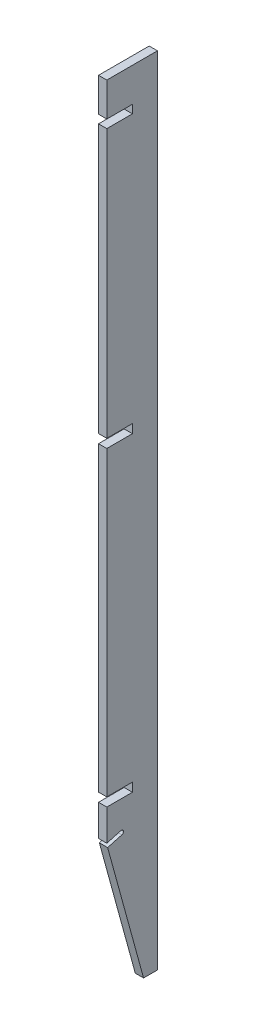
ISO-10303-21;
HEADER;
FILE_DESCRIPTION(('STEP AP214'),'2;1');
FILE_NAME('part.step','',(''),(''),'','','');
FILE_SCHEMA(('AUTOMOTIVE_DESIGN { 1 0 10303 214 1 1 1 1 }'));
ENDSEC;
DATA;
#1=APPLICATION_CONTEXT('core data for automotive mechanical design processes');
#2=APPLICATION_PROTOCOL_DEFINITION('international standard','automotive_design',2000,#1);
#3=PRODUCT_CONTEXT('',#1,'mechanical');
#4=PRODUCT('Part','Part','',(#3));
#5=PRODUCT_RELATED_PRODUCT_CATEGORY('part','',(#4));
#6=PRODUCT_DEFINITION_FORMATION('','',#4);
#7=PRODUCT_DEFINITION_CONTEXT('part definition',#1,'design');
#8=PRODUCT_DEFINITION('design','',#6,#7);
#9=PRODUCT_DEFINITION_SHAPE('','',#8);
#10=(LENGTH_UNIT() NAMED_UNIT(*) SI_UNIT(.MILLI.,.METRE.));
#11=(NAMED_UNIT(*) PLANE_ANGLE_UNIT() SI_UNIT($,.RADIAN.));
#12=(NAMED_UNIT(*) SI_UNIT($,.STERADIAN.) SOLID_ANGLE_UNIT());
#13=UNCERTAINTY_MEASURE_WITH_UNIT(LENGTH_MEASURE(1.E-05),#10,'distance_accuracy_value','');
#14=(GEOMETRIC_REPRESENTATION_CONTEXT(3) GLOBAL_UNCERTAINTY_ASSIGNED_CONTEXT((#13)) GLOBAL_UNIT_ASSIGNED_CONTEXT((#10,
#11,#12)) REPRESENTATION_CONTEXT('',''));
#15=CARTESIAN_POINT('',(0.,0.,0.));
#16=DIRECTION('',(0.,0.,1.));
#17=DIRECTION('',(1.,0.,0.));
#18=AXIS2_PLACEMENT_3D('',#15,#16,#17);
#19=CARTESIAN_POINT('',(-88.646,186.648691114934,38.1));
#20=DIRECTION('',(0.,-0.26471698178117,0.964326147917118));
#21=DIRECTION('',(0.,-0.964326147917118,-0.26471698178117));
#22=AXIS2_PLACEMENT_3D('',#19,#20,#21);
#23=PLANE('',#22);
#24=DIRECTION('',(0.,-0.964326147917118,-0.26471698178117));
#25=VECTOR('',#24,1.);
#26=CARTESIAN_POINT('',(-76.2,186.648691114934,38.1));
#27=LINE('',#26,#25);
#28=CARTESIAN_POINT('',(-76.2,320.899792352557,74.9532434769948));
#29=VERTEX_POINT('',#28);
#30=CARTESIAN_POINT('',(-76.2,124.055833972077,20.9176470588238));
#31=VERTEX_POINT('',#30);
#32=EDGE_CURVE('E286',#29,#31,#27,.T.);
#33=ORIENTED_EDGE('',*,*,#32,.F.);
#34=DIRECTION('',(-1.,0.,0.));
#35=VECTOR('',#34,1.);
#36=CARTESIAN_POINT('',(2294.93415908109,320.899792352557,74.9532434769948));
#37=LINE('',#36,#35);
#38=CARTESIAN_POINT('',(-88.646,320.899792352557,74.9532434769948));
#39=VERTEX_POINT('',#38);
#40=EDGE_CURVE('E35',#29,#39,#37,.T.);
#41=ORIENTED_EDGE('',*,*,#40,.T.);
#42=DIRECTION('',(0.,-0.964326147917118,-0.26471698178117));
#43=VECTOR('',#42,1.);
#44=CARTESIAN_POINT('',(-88.646,186.648691114934,38.1));
#45=LINE('',#44,#43);
#46=CARTESIAN_POINT('',(-88.646,124.055833972077,20.9176470588238));
#47=VERTEX_POINT('',#46);
#48=EDGE_CURVE('E297',#39,#47,#45,.T.);
#49=ORIENTED_EDGE('',*,*,#48,.T.);
#50=DIRECTION('',(1.,0.,0.));
#51=VECTOR('',#50,1.);
#52=CARTESIAN_POINT('',(-88.646,124.055833972077,20.9176470588238));
#53=LINE('',#52,#51);
#54=EDGE_CURVE('E230',#47,#31,#53,.T.);
#55=ORIENTED_EDGE('',*,*,#54,.T.);
#56=EDGE_LOOP('',(#33,#41,#49,#55));
#57=FACE_BOUND('',#56,.T.);
#58=ADVANCED_FACE('F14',(#57),#23,.T.);
#59=CARTESIAN_POINT('',(-88.646,822.325,76.2));
#60=DIRECTION('',(0.,0.,1.));
#61=DIRECTION('',(1.,0.,0.));
#62=AXIS2_PLACEMENT_3D('',#59,#60,#61);
#63=PLANE('',#62);
#64=DIRECTION('',(0.,-1.,0.));
#65=VECTOR('',#64,1.);
#66=CARTESIAN_POINT('',(-76.2,822.325,76.2));
#67=LINE('',#66,#65);
#68=CARTESIAN_POINT('',(-76.2,1257.554,76.2));
#69=VERTEX_POINT('',#68);
#70=CARTESIAN_POINT('',(-76.2,854.329,76.2));
#71=VERTEX_POINT('',#70);
#72=EDGE_CURVE('E293',#69,#71,#67,.T.);
#73=ORIENTED_EDGE('',*,*,#72,.F.);
#74=DIRECTION('',(-1.,0.,0.));
#75=VECTOR('',#74,1.);
#76=CARTESIAN_POINT('',(3476.61458781172,1257.554,76.2));
#77=LINE('',#76,#75);
#78=CARTESIAN_POINT('',(-88.646,1257.554,76.2));
#79=VERTEX_POINT('',#78);
#80=EDGE_CURVE('E331',#69,#79,#77,.T.);
#81=ORIENTED_EDGE('',*,*,#80,.T.);
#82=DIRECTION('',(0.,-1.,0.));
#83=VECTOR('',#82,1.);
#84=CARTESIAN_POINT('',(-88.646,822.325,76.2));
#85=LINE('',#84,#83);
#86=CARTESIAN_POINT('',(-88.646,854.329,76.2));
#87=VERTEX_POINT('',#86);
#88=EDGE_CURVE('E304',#79,#87,#85,.T.);
#89=ORIENTED_EDGE('',*,*,#88,.T.);
#90=DIRECTION('',(-1.,0.,0.));
#91=VECTOR('',#90,1.);
#92=CARTESIAN_POINT('',(3476.61458781172,854.329,76.2));
#93=LINE('',#92,#91);
#94=EDGE_CURVE('E312',#71,#87,#93,.T.);
#95=ORIENTED_EDGE('',*,*,#94,.F.);
#96=EDGE_LOOP('',(#73,#81,#89,#95));
#97=FACE_BOUND('',#96,.T.);
#98=ADVANCED_FACE('F430',(#97),#63,.T.);
#99=DIRECTION('',(-1.,0.,0.));
#100=VECTOR('',#99,1.);
#101=CARTESIAN_POINT('',(-88.646,327.142454536111,76.2));
#102=LINE('',#101,#100);
#103=CARTESIAN_POINT('',(-76.2,327.142454536111,76.2));
#104=VERTEX_POINT('',#103);
#105=CARTESIAN_POINT('',(-88.646,327.142454536111,76.2));
#106=VERTEX_POINT('',#105);
#107=EDGE_CURVE('E382',#104,#106,#102,.T.);
#108=ORIENTED_EDGE('',*,*,#107,.F.);
#109=CARTESIAN_POINT('',(-76.2,374.269,76.2));
#110=VERTEX_POINT('',#109);
#111=EDGE_CURVE('E294',#110,#104,#67,.T.);
#112=ORIENTED_EDGE('',*,*,#111,.F.);
#113=DIRECTION('',(-1.,0.,0.));
#114=VECTOR('',#113,1.);
#115=CARTESIAN_POINT('',(3476.61458781172,374.269,76.2));
#116=LINE('',#115,#114);
#117=CARTESIAN_POINT('',(-88.646,374.269,76.2));
#118=VERTEX_POINT('',#117);
#119=EDGE_CURVE('E362',#110,#118,#116,.T.);
#120=ORIENTED_EDGE('',*,*,#119,.T.);
#121=EDGE_CURVE('E282',#118,#106,#85,.T.);
#122=ORIENTED_EDGE('',*,*,#121,.T.);
#123=EDGE_LOOP('',(#108,#112,#120,#122));
#124=FACE_BOUND('',#123,.T.);
#125=ADVANCED_FACE('F448',(#124),#63,.T.);
#126=DIRECTION('',(-1.,0.,0.));
#127=VECTOR('',#126,1.);
#128=CARTESIAN_POINT('',(3476.61458781172,387.477,76.2));
#129=LINE('',#128,#127);
#130=CARTESIAN_POINT('',(-76.2,387.477,76.2));
#131=VERTEX_POINT('',#130);
#132=CARTESIAN_POINT('',(-88.646,387.477,76.2));
#133=VERTEX_POINT('',#132);
#134=EDGE_CURVE('E366',#131,#133,#129,.T.);
#135=ORIENTED_EDGE('',*,*,#134,.F.);
#136=CARTESIAN_POINT('',(-76.2,841.121,76.2));
#137=VERTEX_POINT('',#136);
#138=EDGE_CURVE('E433',#137,#131,#67,.T.);
#139=ORIENTED_EDGE('',*,*,#138,.F.);
#140=DIRECTION('',(-1.,0.,0.));
#141=VECTOR('',#140,1.);
#142=CARTESIAN_POINT('',(3476.61458781172,841.121,76.2));
#143=LINE('',#142,#141);
#144=CARTESIAN_POINT('',(-88.646,841.121,76.2));
#145=VERTEX_POINT('',#144);
#146=EDGE_CURVE('E315',#137,#145,#143,.T.);
#147=ORIENTED_EDGE('',*,*,#146,.T.);
#148=EDGE_CURVE('E454',#145,#133,#85,.T.);
#149=ORIENTED_EDGE('',*,*,#148,.T.);
#150=EDGE_LOOP('',(#135,#139,#147,#149));
#151=FACE_BOUND('',#150,.T.);
#152=ADVANCED_FACE('F475',(#151),#63,.T.);
#153=CARTESIAN_POINT('',(-88.646,709.72791698604,44.45));
#154=DIRECTION('',(1.,0.,0.));
#155=DIRECTION('',(0.,1.,0.));
#156=AXIS2_PLACEMENT_3D('',#153,#154,#155);
#157=PLANE('',#156);
#158=CARTESIAN_POINT('',(-88.646,329.844862792281,54.361571256692));
#159=DIRECTION('',(1.,0.,0.));
#160=DIRECTION('',(0.,1.,0.));
#161=AXIS2_PLACEMENT_3D('',#158,#159,#160);
#162=CIRCLE('',#161,3.175);
#163=CARTESIAN_POINT('',(-88.646,326.783127272644,53.5210948395368));
#164=VERTEX_POINT('',#163);
#165=CARTESIAN_POINT('',(-88.646,332.906598311917,55.2020476738473));
#166=VERTEX_POINT('',#165);
#167=EDGE_CURVE('E211',#164,#166,#162,.T.);
#168=ORIENTED_EDGE('',*,*,#167,.T.);
#169=DIRECTION('',(0.,-0.26471698178117,0.964326147917118));
#170=VECTOR('',#169,1.);
#171=CARTESIAN_POINT('',(-88.646,362.057095451444,-50.9890490487127));
#172=LINE('',#171,#170);
#173=EDGE_CURVE('E356',#166,#106,#172,.T.);
#174=ORIENTED_EDGE('',*,*,#173,.T.);
#175=ORIENTED_EDGE('',*,*,#121,.F.);
#176=DIRECTION('',(0.,0.,-1.));
#177=VECTOR('',#176,1.);
#178=CARTESIAN_POINT('',(-88.646,374.269,44.45));
#179=LINE('',#178,#177);
#180=CARTESIAN_POINT('',(-88.646,374.269,37.719));
#181=VERTEX_POINT('',#180);
#182=EDGE_CURVE('E369',#118,#181,#179,.T.);
#183=ORIENTED_EDGE('',*,*,#182,.T.);
#184=DIRECTION('',(0.,-1.,0.));
#185=VECTOR('',#184,1.);
#186=CARTESIAN_POINT('',(-88.646,847.725,37.719));
#187=LINE('',#186,#185);
#188=CARTESIAN_POINT('',(-88.646,387.477,37.719));
#189=VERTEX_POINT('',#188);
#190=EDGE_CURVE('E373',#189,#181,#187,.T.);
#191=ORIENTED_EDGE('',*,*,#190,.F.);
#192=DIRECTION('',(0.,0.,1.));
#193=VECTOR('',#192,1.);
#194=CARTESIAN_POINT('',(-88.646,387.477,44.45));
#195=LINE('',#194,#193);
#196=EDGE_CURVE('E345',#189,#133,#195,.T.);
#197=ORIENTED_EDGE('',*,*,#196,.T.);
#198=ORIENTED_EDGE('',*,*,#148,.F.);
#199=DIRECTION('',(0.,0.,-1.));
#200=VECTOR('',#199,1.);
#201=CARTESIAN_POINT('',(-88.646,841.121,38.1));
#202=LINE('',#201,#200);
#203=CARTESIAN_POINT('',(-88.646,841.121,37.719));
#204=VERTEX_POINT('',#203);
#205=EDGE_CURVE('E309',#145,#204,#202,.T.);
#206=ORIENTED_EDGE('',*,*,#205,.T.);
#207=DIRECTION('',(0.,-1.,0.));
#208=VECTOR('',#207,1.);
#209=CARTESIAN_POINT('',(-88.646,847.725,37.719));
#210=LINE('',#209,#208);
#211=CARTESIAN_POINT('',(-88.646,854.329,37.719));
#212=VERTEX_POINT('',#211);
#213=EDGE_CURVE('E326',#212,#204,#210,.T.);
#214=ORIENTED_EDGE('',*,*,#213,.F.);
#215=DIRECTION('',(0.,0.,1.));
#216=VECTOR('',#215,1.);
#217=CARTESIAN_POINT('',(-88.646,854.329,38.1));
#218=LINE('',#217,#216);
#219=EDGE_CURVE('E322',#212,#87,#218,.T.);
#220=ORIENTED_EDGE('',*,*,#219,.T.);
#221=ORIENTED_EDGE('',*,*,#88,.F.);
#222=DIRECTION('',(0.,0.,1.));
#223=VECTOR('',#222,1.);
#224=CARTESIAN_POINT('',(-88.646,1257.554,56.9595));
#225=LINE('',#224,#223);
#226=CARTESIAN_POINT('',(-88.646,1257.554,37.719));
#227=VERTEX_POINT('',#226);
#228=EDGE_CURVE('E353',#227,#79,#225,.T.);
#229=ORIENTED_EDGE('',*,*,#228,.F.);
#230=DIRECTION('',(0.,1.,0.));
#231=VECTOR('',#230,1.);
#232=CARTESIAN_POINT('',(-88.646,1263.777,37.719));
#233=LINE('',#232,#231);
#234=CARTESIAN_POINT('',(-88.646,1270.,37.719));
#235=VERTEX_POINT('',#234);
#236=EDGE_CURVE('E349',#227,#235,#233,.T.);
#237=ORIENTED_EDGE('',*,*,#236,.T.);
#238=DIRECTION('',(0.,0.,-1.));
#239=VECTOR('',#238,1.);
#240=CARTESIAN_POINT('',(-88.646,1270.,56.9595));
#241=LINE('',#240,#239);
#242=CARTESIAN_POINT('',(-88.646,1270.,76.2));
#243=VERTEX_POINT('',#242);
#244=EDGE_CURVE('E336',#243,#235,#241,.T.);
#245=ORIENTED_EDGE('',*,*,#244,.F.);
#246=CARTESIAN_POINT('',(-88.646,1320.8,76.2));
#247=VERTEX_POINT('',#246);
#248=EDGE_CURVE('E300',#247,#243,#85,.T.);
#249=ORIENTED_EDGE('',*,*,#248,.F.);
#250=DIRECTION('',(0.,0.,1.));
#251=VECTOR('',#250,1.);
#252=CARTESIAN_POINT('',(-88.646,1320.8,44.45));
#253=LINE('',#252,#251);
#254=CARTESIAN_POINT('',(-88.646,1320.8,0.));
#255=VERTEX_POINT('',#254);
#256=EDGE_CURVE('E271',#255,#247,#253,.T.);
#257=ORIENTED_EDGE('',*,*,#256,.F.);
#258=DIRECTION('',(0.,1.,0.));
#259=VECTOR('',#258,1.);
#260=CARTESIAN_POINT('',(-88.646,709.72791698604,1.196959198424E-13));
#261=LINE('',#260,#259);
#262=CARTESIAN_POINT('',(-88.646,124.055833972077,2.25611489484112E-13));
#263=VERTEX_POINT('',#262);
#264=EDGE_CURVE('E275',#263,#255,#261,.T.);
#265=ORIENTED_EDGE('',*,*,#264,.F.);
#266=DIRECTION('',(0.,0.,-1.));
#267=VECTOR('',#266,1.);
#268=CARTESIAN_POINT('',(-88.646,124.055833972077,20.9176470588238));
#269=LINE('',#268,#267);
#270=EDGE_CURVE('E204',#263,#47,#269,.F.);
#271=ORIENTED_EDGE('',*,*,#270,.T.);
#272=ORIENTED_EDGE('',*,*,#48,.F.);
#273=DIRECTION('',(0.,-0.26471698178117,0.964326147917118));
#274=VECTOR('',#273,1.);
#275=CARTESIAN_POINT('',(-88.646,355.93362441217,-52.6700018830231));
#276=LINE('',#275,#274);
#277=EDGE_CURVE('E387',#164,#39,#276,.T.);
#278=ORIENTED_EDGE('',*,*,#277,.F.);
#279=EDGE_LOOP('',(#168,#174,#175,#183,#191,#197,#198,#206,#214,#220,#221,#229,#237,#245,#249,
#257,#265,#271,#272,#278));
#280=FACE_BOUND('',#279,.T.);
#281=ADVANCED_FACE('F397',(#280),#157,.F.);
#282=CARTESIAN_POINT('',(-76.2,709.72791698604,44.45));
#283=DIRECTION('',(1.,0.,0.));
#284=DIRECTION('',(0.,1.,0.));
#285=AXIS2_PLACEMENT_3D('',#282,#283,#284);
#286=PLANE('',#285);
#287=DIRECTION('',(0.,-0.26471698178117,0.964326147917118));
#288=VECTOR('',#287,1.);
#289=CARTESIAN_POINT('',(-76.2,362.057095451444,-50.9890490487127));
#290=LINE('',#289,#288);
#291=CARTESIAN_POINT('',(-76.2,332.906598311917,55.2020476738473));
#292=VERTEX_POINT('',#291);
#293=EDGE_CURVE('E9',#292,#104,#290,.T.);
#294=ORIENTED_EDGE('',*,*,#293,.F.);
#295=CARTESIAN_POINT('',(-76.2,329.844862792281,54.361571256692));
#296=DIRECTION('',(1.,0.,0.));
#297=DIRECTION('',(0.,1.,0.));
#298=AXIS2_PLACEMENT_3D('',#295,#296,#297);
#299=CIRCLE('',#298,3.175);
#300=CARTESIAN_POINT('',(-76.2,326.783127272644,53.5210948395368));
#301=VERTEX_POINT('',#300);
#302=EDGE_CURVE('E23',#301,#292,#299,.T.);
#303=ORIENTED_EDGE('',*,*,#302,.F.);
#304=DIRECTION('',(0.,-0.26471698178117,0.964326147917118));
#305=VECTOR('',#304,1.);
#306=CARTESIAN_POINT('',(-76.2,355.93362441217,-52.6700018830231));
#307=LINE('',#306,#305);
#308=EDGE_CURVE('E195',#301,#29,#307,.T.);
#309=ORIENTED_EDGE('',*,*,#308,.T.);
#310=ORIENTED_EDGE('',*,*,#32,.T.);
#311=DIRECTION('',(0.,0.,1.));
#312=VECTOR('',#311,1.);
#313=CARTESIAN_POINT('',(-76.2,124.055833972077,44.4499999999961));
#314=LINE('',#313,#312);
#315=CARTESIAN_POINT('',(-76.2,124.055833972077,2.25611489484112E-13));
#316=VERTEX_POINT('',#315);
#317=EDGE_CURVE('E227',#31,#316,#314,.F.);
#318=ORIENTED_EDGE('',*,*,#317,.T.);
#319=DIRECTION('',(0.,1.,0.));
#320=VECTOR('',#319,1.);
#321=CARTESIAN_POINT('',(-76.2,709.72791698604,1.196959198424E-13));
#322=LINE('',#321,#320);
#323=CARTESIAN_POINT('',(-76.2,1320.8,0.));
#324=VERTEX_POINT('',#323);
#325=EDGE_CURVE('E283',#316,#324,#322,.T.);
#326=ORIENTED_EDGE('',*,*,#325,.T.);
#327=DIRECTION('',(0.,0.,1.));
#328=VECTOR('',#327,1.);
#329=CARTESIAN_POINT('',(-76.2,1320.8,44.45));
#330=LINE('',#329,#328);
#331=CARTESIAN_POINT('',(-76.2,1320.8,76.2));
#332=VERTEX_POINT('',#331);
#333=EDGE_CURVE('E278',#324,#332,#330,.T.);
#334=ORIENTED_EDGE('',*,*,#333,.T.);
#335=CARTESIAN_POINT('',(-76.2,1270.,76.2));
#336=VERTEX_POINT('',#335);
#337=EDGE_CURVE('E289',#332,#336,#67,.T.);
#338=ORIENTED_EDGE('',*,*,#337,.T.);
#339=DIRECTION('',(0.,0.,1.));
#340=VECTOR('',#339,1.);
#341=CARTESIAN_POINT('',(-76.2,1270.,44.45));
#342=LINE('',#341,#340);
#343=CARTESIAN_POINT('',(-76.2,1270.,37.719));
#344=VERTEX_POINT('',#343);
#345=EDGE_CURVE('E234',#344,#336,#342,.T.);
#346=ORIENTED_EDGE('',*,*,#345,.F.);
#347=DIRECTION('',(0.,-1.,0.));
#348=VECTOR('',#347,1.);
#349=CARTESIAN_POINT('',(-76.2,709.72791698604,37.719));
#350=LINE('',#349,#348);
#351=CARTESIAN_POINT('',(-76.2,1257.554,37.719));
#352=VERTEX_POINT('',#351);
#353=EDGE_CURVE('E237',#344,#352,#350,.T.);
#354=ORIENTED_EDGE('',*,*,#353,.T.);
#355=DIRECTION('',(0.,0.,-1.));
#356=VECTOR('',#355,1.);
#357=CARTESIAN_POINT('',(-76.2,1257.554,44.45));
#358=LINE('',#357,#356);
#359=EDGE_CURVE('E241',#69,#352,#358,.T.);
#360=ORIENTED_EDGE('',*,*,#359,.F.);
#361=ORIENTED_EDGE('',*,*,#72,.T.);
#362=DIRECTION('',(0.,0.,-1.));
#363=VECTOR('',#362,1.);
#364=CARTESIAN_POINT('',(-76.2,854.329,44.45));
#365=LINE('',#364,#363);
#366=CARTESIAN_POINT('',(-76.2,854.329,37.719));
#367=VERTEX_POINT('',#366);
#368=EDGE_CURVE('E259',#71,#367,#365,.T.);
#369=ORIENTED_EDGE('',*,*,#368,.T.);
#370=DIRECTION('',(0.,1.,0.));
#371=VECTOR('',#370,1.);
#372=CARTESIAN_POINT('',(-76.2,709.72791698604,37.719));
#373=LINE('',#372,#371);
#374=CARTESIAN_POINT('',(-76.2,841.121,37.719));
#375=VERTEX_POINT('',#374);
#376=EDGE_CURVE('E263',#375,#367,#373,.T.);
#377=ORIENTED_EDGE('',*,*,#376,.F.);
#378=DIRECTION('',(0.,0.,1.));
#379=VECTOR('',#378,1.);
#380=CARTESIAN_POINT('',(-76.2,841.121,44.45));
#381=LINE('',#380,#379);
#382=EDGE_CURVE('E255',#375,#137,#381,.T.);
#383=ORIENTED_EDGE('',*,*,#382,.T.);
#384=ORIENTED_EDGE('',*,*,#138,.T.);
#385=DIRECTION('',(0.,0.,-1.));
#386=VECTOR('',#385,1.);
#387=CARTESIAN_POINT('',(-76.2,387.477,44.45));
#388=LINE('',#387,#386);
#389=CARTESIAN_POINT('',(-76.2,387.477,37.719));
#390=VERTEX_POINT('',#389);
#391=EDGE_CURVE('E244',#131,#390,#388,.T.);
#392=ORIENTED_EDGE('',*,*,#391,.T.);
#393=DIRECTION('',(0.,1.,0.));
#394=VECTOR('',#393,1.);
#395=CARTESIAN_POINT('',(-76.2,709.72791698604,37.719));
#396=LINE('',#395,#394);
#397=CARTESIAN_POINT('',(-76.2,374.269,37.719));
#398=VERTEX_POINT('',#397);
#399=EDGE_CURVE('E248',#398,#390,#396,.T.);
#400=ORIENTED_EDGE('',*,*,#399,.F.);
#401=DIRECTION('',(0.,0.,1.));
#402=VECTOR('',#401,1.);
#403=CARTESIAN_POINT('',(-76.2,374.269,44.45));
#404=LINE('',#403,#402);
#405=EDGE_CURVE('E251',#398,#110,#404,.T.);
#406=ORIENTED_EDGE('',*,*,#405,.T.);
#407=ORIENTED_EDGE('',*,*,#111,.T.);
#408=EDGE_LOOP('',(#294,#303,#309,#310,#318,#326,#334,#338,#346,#354,#360,#361,#369,#377,#383,
#384,#392,#400,#406,#407));
#409=FACE_BOUND('',#408,.T.);
#410=ADVANCED_FACE('F216',(#409),#286,.T.);
#411=DIRECTION('',(-1.,0.,0.));
#412=VECTOR('',#411,1.);
#413=CARTESIAN_POINT('',(3476.61458781172,1270.,76.2));
#414=LINE('',#413,#412);
#415=EDGE_CURVE('E342',#336,#243,#414,.T.);
#416=ORIENTED_EDGE('',*,*,#415,.F.);
#417=ORIENTED_EDGE('',*,*,#337,.F.);
#418=DIRECTION('',(1.,0.,0.));
#419=VECTOR('',#418,1.);
#420=CARTESIAN_POINT('',(-88.646,1320.8,76.2));
#421=LINE('',#420,#419);
#422=EDGE_CURVE('E270',#247,#332,#421,.T.);
#423=ORIENTED_EDGE('',*,*,#422,.F.);
#424=ORIENTED_EDGE('',*,*,#248,.T.);
#425=EDGE_LOOP('',(#416,#417,#423,#424));
#426=FACE_BOUND('',#425,.T.);
#427=ADVANCED_FACE('F412',(#426),#63,.T.);
#428=CARTESIAN_POINT('',(-88.646,709.72791698604,1.196959198424E-13));
#429=DIRECTION('',(0.,0.,-1.));
#430=DIRECTION('',(0.,1.,0.));
#431=AXIS2_PLACEMENT_3D('',#428,#429,#430);
#432=PLANE('',#431);
#433=ORIENTED_EDGE('',*,*,#325,.F.);
#434=DIRECTION('',(-1.,0.,0.));
#435=VECTOR('',#434,1.);
#436=CARTESIAN_POINT('',(-88.646,124.055833972077,2.25611489484112E-13));
#437=LINE('',#436,#435);
#438=EDGE_CURVE('E47',#316,#263,#437,.T.);
#439=ORIENTED_EDGE('',*,*,#438,.T.);
#440=ORIENTED_EDGE('',*,*,#264,.T.);
#441=DIRECTION('',(1.,0.,0.));
#442=VECTOR('',#441,1.);
#443=CARTESIAN_POINT('',(-88.646,1320.8,0.));
#444=LINE('',#443,#442);
#445=EDGE_CURVE('E266',#255,#324,#444,.T.);
#446=ORIENTED_EDGE('',*,*,#445,.T.);
#447=EDGE_LOOP('',(#433,#439,#440,#446));
#448=FACE_BOUND('',#447,.T.);
#449=ADVANCED_FACE('F403',(#448),#432,.T.);
#450=CARTESIAN_POINT('',(-88.646,1320.8,38.1));
#451=DIRECTION('',(0.,1.,0.));
#452=DIRECTION('',(-1.,0.,0.));
#453=AXIS2_PLACEMENT_3D('',#450,#451,#452);
#454=PLANE('',#453);
#455=ORIENTED_EDGE('',*,*,#333,.F.);
#456=ORIENTED_EDGE('',*,*,#445,.F.);
#457=ORIENTED_EDGE('',*,*,#256,.T.);
#458=ORIENTED_EDGE('',*,*,#422,.T.);
#459=EDGE_LOOP('',(#455,#456,#457,#458));
#460=FACE_BOUND('',#459,.T.);
#461=ADVANCED_FACE('F407',(#460),#454,.T.);
#462=CARTESIAN_POINT('',(3476.61458781172,841.121,38.1));
#463=DIRECTION('',(0.,1.,0.));
#464=DIRECTION('',(-1.,0.,0.));
#465=AXIS2_PLACEMENT_3D('',#462,#463,#464);
#466=PLANE('',#465);
#467=DIRECTION('',(-1.,0.,0.));
#468=VECTOR('',#467,1.);
#469=CARTESIAN_POINT('',(3476.61458781172,841.121,37.719));
#470=LINE('',#469,#468);
#471=EDGE_CURVE('E305',#375,#204,#470,.T.);
#472=ORIENTED_EDGE('',*,*,#471,.T.);
#473=ORIENTED_EDGE('',*,*,#205,.F.);
#474=ORIENTED_EDGE('',*,*,#146,.F.);
#475=ORIENTED_EDGE('',*,*,#382,.F.);
#476=EDGE_LOOP('',(#472,#473,#474,#475));
#477=FACE_BOUND('',#476,.T.);
#478=ADVANCED_FACE('F474',(#477),#466,.T.);
#479=CARTESIAN_POINT('',(3476.61458781172,854.329,38.1));
#480=DIRECTION('',(0.,-1.,0.));
#481=DIRECTION('',(1.,0.,0.));
#482=AXIS2_PLACEMENT_3D('',#479,#480,#481);
#483=PLANE('',#482);
#484=ORIENTED_EDGE('',*,*,#94,.T.);
#485=ORIENTED_EDGE('',*,*,#219,.F.);
#486=DIRECTION('',(-1.,0.,0.));
#487=VECTOR('',#486,1.);
#488=CARTESIAN_POINT('',(3476.61458781172,854.329,37.719));
#489=LINE('',#488,#487);
#490=EDGE_CURVE('E308',#367,#212,#489,.T.);
#491=ORIENTED_EDGE('',*,*,#490,.F.);
#492=ORIENTED_EDGE('',*,*,#368,.F.);
#493=EDGE_LOOP('',(#484,#485,#491,#492));
#494=FACE_BOUND('',#493,.T.);
#495=ADVANCED_FACE('F468',(#494),#483,.T.);
#496=CARTESIAN_POINT('',(3476.61458781172,847.725,37.719));
#497=DIRECTION('',(0.,0.,-1.));
#498=DIRECTION('',(-1.,0.,0.));
#499=AXIS2_PLACEMENT_3D('',#496,#497,#498);
#500=PLANE('',#499);
#501=ORIENTED_EDGE('',*,*,#376,.T.);
#502=ORIENTED_EDGE('',*,*,#490,.T.);
#503=ORIENTED_EDGE('',*,*,#213,.T.);
#504=ORIENTED_EDGE('',*,*,#471,.F.);
#505=EDGE_LOOP('',(#501,#502,#503,#504));
#506=FACE_BOUND('',#505,.T.);
#507=ADVANCED_FACE('F472',(#506),#500,.F.);
#508=CARTESIAN_POINT('',(3476.61458781172,387.477,44.45));
#509=DIRECTION('',(0.,-1.,0.));
#510=DIRECTION('',(1.,0.,0.));
#511=AXIS2_PLACEMENT_3D('',#508,#509,#510);
#512=PLANE('',#511);
#513=ORIENTED_EDGE('',*,*,#134,.T.);
#514=ORIENTED_EDGE('',*,*,#196,.F.);
#515=DIRECTION('',(-1.,0.,0.));
#516=VECTOR('',#515,1.);
#517=CARTESIAN_POINT('',(3476.61458781172,387.477,37.719));
#518=LINE('',#517,#516);
#519=EDGE_CURVE('E330',#390,#189,#518,.T.);
#520=ORIENTED_EDGE('',*,*,#519,.F.);
#521=ORIENTED_EDGE('',*,*,#391,.F.);
#522=EDGE_LOOP('',(#513,#514,#520,#521));
#523=FACE_BOUND('',#522,.T.);
#524=ADVANCED_FACE('F479',(#523),#512,.T.);
#525=CARTESIAN_POINT('',(3476.61458781172,847.725,37.719));
#526=DIRECTION('',(0.,0.,-1.));
#527=DIRECTION('',(-1.,0.,0.));
#528=AXIS2_PLACEMENT_3D('',#525,#526,#527);
#529=PLANE('',#528);
#530=ORIENTED_EDGE('',*,*,#399,.T.);
#531=ORIENTED_EDGE('',*,*,#519,.T.);
#532=ORIENTED_EDGE('',*,*,#190,.T.);
#533=DIRECTION('',(-1.,0.,0.));
#534=VECTOR('',#533,1.);
#535=CARTESIAN_POINT('',(3476.61458781172,374.269,37.719));
#536=LINE('',#535,#534);
#537=EDGE_CURVE('E359',#398,#181,#536,.T.);
#538=ORIENTED_EDGE('',*,*,#537,.F.);
#539=EDGE_LOOP('',(#530,#531,#532,#538));
#540=FACE_BOUND('',#539,.T.);
#541=ADVANCED_FACE('F482',(#540),#529,.F.);
#542=CARTESIAN_POINT('',(3476.61458781172,374.269,44.45));
#543=DIRECTION('',(0.,1.,0.));
#544=DIRECTION('',(-1.,0.,0.));
#545=AXIS2_PLACEMENT_3D('',#542,#543,#544);
#546=PLANE('',#545);
#547=ORIENTED_EDGE('',*,*,#537,.T.);
#548=ORIENTED_EDGE('',*,*,#182,.F.);
#549=ORIENTED_EDGE('',*,*,#119,.F.);
#550=ORIENTED_EDGE('',*,*,#405,.F.);
#551=EDGE_LOOP('',(#547,#548,#549,#550));
#552=FACE_BOUND('',#551,.T.);
#553=ADVANCED_FACE('F484',(#552),#546,.T.);
#554=CARTESIAN_POINT('',(3476.61458781172,1270.,56.9595));
#555=DIRECTION('',(0.,1.,0.));
#556=DIRECTION('',(-1.,0.,0.));
#557=AXIS2_PLACEMENT_3D('',#554,#555,#556);
#558=PLANE('',#557);
#559=ORIENTED_EDGE('',*,*,#345,.T.);
#560=ORIENTED_EDGE('',*,*,#415,.T.);
#561=ORIENTED_EDGE('',*,*,#244,.T.);
#562=DIRECTION('',(-1.,0.,0.));
#563=VECTOR('',#562,1.);
#564=CARTESIAN_POINT('',(3476.61458781172,1270.,37.719));
#565=LINE('',#564,#563);
#566=EDGE_CURVE('E339',#344,#235,#565,.T.);
#567=ORIENTED_EDGE('',*,*,#566,.F.);
#568=EDGE_LOOP('',(#559,#560,#561,#567));
#569=FACE_BOUND('',#568,.T.);
#570=ADVANCED_FACE('F416',(#569),#558,.F.);
#571=CARTESIAN_POINT('',(3476.61458781172,1263.777,37.719));
#572=DIRECTION('',(0.,0.,1.));
#573=DIRECTION('',(1.,0.,0.));
#574=AXIS2_PLACEMENT_3D('',#571,#572,#573);
#575=PLANE('',#574);
#576=ORIENTED_EDGE('',*,*,#566,.T.);
#577=ORIENTED_EDGE('',*,*,#236,.F.);
#578=DIRECTION('',(-1.,0.,0.));
#579=VECTOR('',#578,1.);
#580=CARTESIAN_POINT('',(3476.61458781172,1257.554,37.719));
#581=LINE('',#580,#579);
#582=EDGE_CURVE('E335',#352,#227,#581,.T.);
#583=ORIENTED_EDGE('',*,*,#582,.F.);
#584=ORIENTED_EDGE('',*,*,#353,.F.);
#585=EDGE_LOOP('',(#576,#577,#583,#584));
#586=FACE_BOUND('',#585,.T.);
#587=ADVANCED_FACE('F423',(#586),#575,.T.);
#588=CARTESIAN_POINT('',(3476.61458781172,1257.554,56.9595));
#589=DIRECTION('',(0.,-1.,0.));
#590=DIRECTION('',(1.,0.,0.));
#591=AXIS2_PLACEMENT_3D('',#588,#589,#590);
#592=PLANE('',#591);
#593=ORIENTED_EDGE('',*,*,#359,.T.);
#594=ORIENTED_EDGE('',*,*,#582,.T.);
#595=ORIENTED_EDGE('',*,*,#228,.T.);
#596=ORIENTED_EDGE('',*,*,#80,.F.);
#597=EDGE_LOOP('',(#593,#594,#595,#596));
#598=FACE_BOUND('',#597,.T.);
#599=ADVANCED_FACE('F678',(#598),#592,.F.);
#600=CARTESIAN_POINT('',(-88.646,124.055833972077,20.9176470588238));
#601=DIRECTION('',(0.,1.,0.));
#602=DIRECTION('',(1.,0.,0.));
#603=AXIS2_PLACEMENT_3D('',#600,#601,#602);
#604=PLANE('',#603);
#605=ORIENTED_EDGE('',*,*,#270,.F.);
#606=ORIENTED_EDGE('',*,*,#438,.F.);
#607=ORIENTED_EDGE('',*,*,#317,.F.);
#608=ORIENTED_EDGE('',*,*,#54,.F.);
#609=EDGE_LOOP('',(#605,#606,#607,#608));
#610=FACE_BOUND('',#609,.T.);
#611=ADVANCED_FACE('F16',(#610),#604,.F.);
#612=CARTESIAN_POINT('',(2294.93415908109,330.049233053331,65.6110211158403));
#613=DIRECTION('',(0.,0.964326147917118,0.26471698178117));
#614=DIRECTION('',(0.,-0.26471698178117,0.964326147917118));
#615=AXIS2_PLACEMENT_3D('',#612,#613,#614);
#616=PLANE('',#615);
#617=DIRECTION('',(-1.,0.,0.));
#618=VECTOR('',#617,1.);
#619=CARTESIAN_POINT('',(2294.93415908109,332.906598311918,55.2020476738473));
#620=LINE('',#619,#618);
#621=EDGE_CURVE('E213',#292,#166,#620,.T.);
#622=ORIENTED_EDGE('',*,*,#621,.F.);
#623=ORIENTED_EDGE('',*,*,#293,.T.);
#624=ORIENTED_EDGE('',*,*,#107,.T.);
#625=ORIENTED_EDGE('',*,*,#173,.F.);
#626=EDGE_LOOP('',(#622,#623,#624,#625));
#627=FACE_BOUND('',#626,.T.);
#628=ADVANCED_FACE('F452',(#627),#616,.F.);
#629=CARTESIAN_POINT('',(2294.93415908109,329.844862792281,54.361571256692));
#630=DIRECTION('',(-1.,0.,0.));
#631=DIRECTION('',(0.,-1.,0.));
#632=AXIS2_PLACEMENT_3D('',#629,#630,#631);
#633=CYLINDRICAL_SURFACE('',#632,3.175);
#634=DIRECTION('',(-1.,0.,0.));
#635=VECTOR('',#634,1.);
#636=CARTESIAN_POINT('',(2294.93415908109,326.783127272644,53.5210948395368));
#637=LINE('',#636,#635);
#638=EDGE_CURVE('E198',#301,#164,#637,.T.);
#639=ORIENTED_EDGE('',*,*,#638,.F.);
#640=ORIENTED_EDGE('',*,*,#302,.T.);
#641=ORIENTED_EDGE('',*,*,#621,.T.);
#642=ORIENTED_EDGE('',*,*,#167,.F.);
#643=EDGE_LOOP('',(#639,#640,#641,#642));
#644=FACE_BOUND('',#643,.T.);
#645=ADVANCED_FACE('F207',(#644),#633,.F.);
#646=CARTESIAN_POINT('',(2294.93415908109,323.930746269763,63.9119113500311));
#647=DIRECTION('',(0.,0.964326147917118,0.26471698178117));
#648=DIRECTION('',(0.,-0.26471698178117,0.964326147917118));
#649=AXIS2_PLACEMENT_3D('',#646,#647,#648);
#650=PLANE('',#649);
#651=ORIENTED_EDGE('',*,*,#277,.T.);
#652=ORIENTED_EDGE('',*,*,#40,.F.);
#653=ORIENTED_EDGE('',*,*,#308,.F.);
#654=ORIENTED_EDGE('',*,*,#638,.T.);
#655=EDGE_LOOP('',(#651,#652,#653,#654));
#656=FACE_BOUND('',#655,.T.);
#657=ADVANCED_FACE('F197',(#656),#650,.T.);
#658=CLOSED_SHELL('',(#58,#98,#125,#152,#281,#410,#427,#449,#461,#478,#495,#507,#524,#541,#553,
#570,#587,#599,#611,#628,#645,#657));
#659=MANIFOLD_SOLID_BREP('B1',#658);
#660=ADVANCED_BREP_SHAPE_REPRESENTATION('',(#18,#659),#14);
#661=SHAPE_DEFINITION_REPRESENTATION(#9,#660);
ENDSEC;
END-ISO-10303-21;
